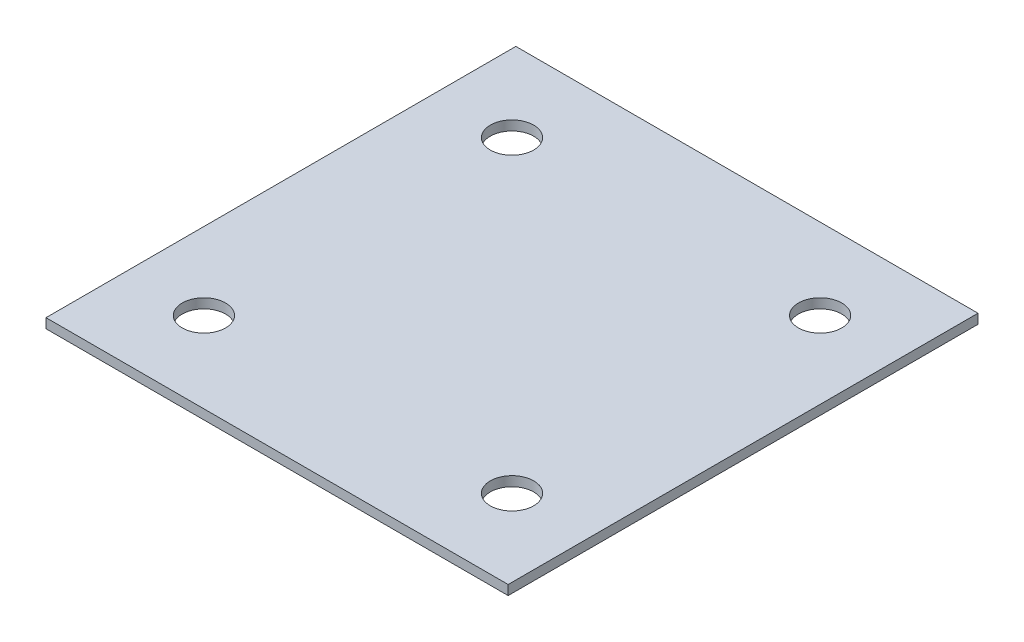
ISO-10303-21;
HEADER;
FILE_DESCRIPTION(('STEP AP214'),'2;1');
FILE_NAME('part.step','',(''),(''),'','','');
FILE_SCHEMA(('AUTOMOTIVE_DESIGN { 1 0 10303 214 1 1 1 1 }'));
ENDSEC;
DATA;
#1=APPLICATION_CONTEXT('core data for automotive mechanical design processes');
#2=APPLICATION_PROTOCOL_DEFINITION('international standard','automotive_design',2000,#1);
#3=PRODUCT_CONTEXT('',#1,'mechanical');
#4=PRODUCT('Part','Part','',(#3));
#5=PRODUCT_RELATED_PRODUCT_CATEGORY('part','',(#4));
#6=PRODUCT_DEFINITION_FORMATION('','',#4);
#7=PRODUCT_DEFINITION_CONTEXT('part definition',#1,'design');
#8=PRODUCT_DEFINITION('design','',#6,#7);
#9=PRODUCT_DEFINITION_SHAPE('','',#8);
#10=(LENGTH_UNIT() NAMED_UNIT(*) SI_UNIT(.MILLI.,.METRE.));
#11=(NAMED_UNIT(*) PLANE_ANGLE_UNIT() SI_UNIT($,.RADIAN.));
#12=(NAMED_UNIT(*) SI_UNIT($,.STERADIAN.) SOLID_ANGLE_UNIT());
#13=UNCERTAINTY_MEASURE_WITH_UNIT(LENGTH_MEASURE(1.E-05),#10,'distance_accuracy_value','');
#14=(GEOMETRIC_REPRESENTATION_CONTEXT(3) GLOBAL_UNCERTAINTY_ASSIGNED_CONTEXT((#13)) GLOBAL_UNIT_ASSIGNED_CONTEXT((#10,
#11,#12)) REPRESENTATION_CONTEXT('',''));
#15=CARTESIAN_POINT('',(0.,0.,0.));
#16=DIRECTION('',(0.,0.,1.));
#17=DIRECTION('',(1.,0.,0.));
#18=AXIS2_PLACEMENT_3D('',#15,#16,#17);
#19=CARTESIAN_POINT('',(0.,3.175,0.));
#20=DIRECTION('',(0.,-1.,0.));
#21=DIRECTION('',(0.,0.,-1.));
#22=AXIS2_PLACEMENT_3D('',#19,#20,#21);
#23=PLANE('',#22);
#24=DIRECTION('',(0.,0.,1.));
#25=VECTOR('',#24,1.);
#26=CARTESIAN_POINT('',(0.,3.175,0.));
#27=LINE('',#26,#25);
#28=CARTESIAN_POINT('',(0.,3.175,-309.88));
#29=VERTEX_POINT('',#28);
#30=CARTESIAN_POINT('',(0.,3.175,0.));
#31=VERTEX_POINT('',#30);
#32=EDGE_CURVE('E98',#29,#31,#27,.T.);
#33=ORIENTED_EDGE('',*,*,#32,.T.);
#34=DIRECTION('',(1.,0.,0.));
#35=VECTOR('',#34,1.);
#36=CARTESIAN_POINT('',(0.,3.175,0.));
#37=LINE('',#36,#35);
#38=CARTESIAN_POINT('',(304.8,3.175,0.));
#39=VERTEX_POINT('',#38);
#40=EDGE_CURVE('E93',#31,#39,#37,.T.);
#41=ORIENTED_EDGE('',*,*,#40,.T.);
#42=DIRECTION('',(0.,0.,-1.));
#43=VECTOR('',#42,1.);
#44=CARTESIAN_POINT('',(304.8,3.175,0.));
#45=LINE('',#44,#43);
#46=CARTESIAN_POINT('',(304.8,3.175,-309.88));
#47=VERTEX_POINT('',#46);
#48=EDGE_CURVE('E96',#39,#47,#45,.T.);
#49=ORIENTED_EDGE('',*,*,#48,.T.);
#50=DIRECTION('',(-1.,0.,0.));
#51=VECTOR('',#50,1.);
#52=CARTESIAN_POINT('',(0.,3.175,-309.88));
#53=LINE('',#52,#51);
#54=EDGE_CURVE('E63',#47,#29,#53,.T.);
#55=ORIENTED_EDGE('',*,*,#54,.T.);
#56=EDGE_LOOP('',(#33,#41,#49,#55));
#57=FACE_BOUND('',#56,.T.);
#58=CARTESIAN_POINT('',(50.8,3.175,-53.34));
#59=DIRECTION('',(0.,1.,0.));
#60=DIRECTION('',(0.,0.,1.));
#61=AXIS2_PLACEMENT_3D('',#58,#59,#60);
#62=CIRCLE('',#61,14.2875);
#63=CARTESIAN_POINT('',(50.8,3.175,-39.0525));
#64=VERTEX_POINT('',#63);
#65=EDGE_CURVE('E118',#64,#64,#62,.T.);
#66=ORIENTED_EDGE('',*,*,#65,.F.);
#67=EDGE_LOOP('',(#66));
#68=FACE_BOUND('',#67,.T.);
#69=CARTESIAN_POINT('',(254.,3.175,-53.34));
#70=DIRECTION('',(0.,1.,0.));
#71=DIRECTION('',(0.,0.,1.));
#72=AXIS2_PLACEMENT_3D('',#69,#70,#71);
#73=CIRCLE('',#72,14.2875);
#74=CARTESIAN_POINT('',(254.,3.175,-39.0525));
#75=VERTEX_POINT('',#74);
#76=EDGE_CURVE('E140',#75,#75,#73,.T.);
#77=ORIENTED_EDGE('',*,*,#76,.F.);
#78=EDGE_LOOP('',(#77));
#79=FACE_BOUND('',#78,.T.);
#80=CARTESIAN_POINT('',(50.8,3.175,-256.54));
#81=DIRECTION('',(0.,1.,0.));
#82=DIRECTION('',(0.,0.,1.));
#83=AXIS2_PLACEMENT_3D('',#80,#81,#82);
#84=CIRCLE('',#83,14.2875);
#85=CARTESIAN_POINT('',(50.8,3.175,-242.2525));
#86=VERTEX_POINT('',#85);
#87=EDGE_CURVE('E148',#86,#86,#84,.T.);
#88=ORIENTED_EDGE('',*,*,#87,.F.);
#89=EDGE_LOOP('',(#88));
#90=FACE_BOUND('',#89,.T.);
#91=CARTESIAN_POINT('',(254.,3.175,-256.54));
#92=DIRECTION('',(0.,1.,0.));
#93=DIRECTION('',(0.,0.,1.));
#94=AXIS2_PLACEMENT_3D('',#91,#92,#93);
#95=CIRCLE('',#94,14.2875);
#96=CARTESIAN_POINT('',(254.,3.175,-242.2525));
#97=VERTEX_POINT('',#96);
#98=EDGE_CURVE('E156',#97,#97,#95,.T.);
#99=ORIENTED_EDGE('',*,*,#98,.F.);
#100=EDGE_LOOP('',(#99));
#101=FACE_BOUND('',#100,.T.);
#102=ADVANCED_FACE('F45',(#57,#68,#79,#90,#101),#23,.F.);
#103=CARTESIAN_POINT('',(0.,-3.175,0.));
#104=DIRECTION('',(0.,-1.,0.));
#105=DIRECTION('',(0.,0.,-1.));
#106=AXIS2_PLACEMENT_3D('',#103,#104,#105);
#107=PLANE('',#106);
#108=CARTESIAN_POINT('',(50.8,-3.175,-256.54));
#109=DIRECTION('',(0.,1.,0.));
#110=DIRECTION('',(0.,0.,1.));
#111=AXIS2_PLACEMENT_3D('',#108,#109,#110);
#112=CIRCLE('',#111,14.2875);
#113=CARTESIAN_POINT('',(50.8,-3.175,-242.2525));
#114=VERTEX_POINT('',#113);
#115=EDGE_CURVE('E152',#114,#114,#112,.T.);
#116=ORIENTED_EDGE('',*,*,#115,.T.);
#117=EDGE_LOOP('',(#116));
#118=FACE_BOUND('',#117,.T.);
#119=CARTESIAN_POINT('',(50.8,-3.175,-53.34));
#120=DIRECTION('',(0.,1.,0.));
#121=DIRECTION('',(0.,0.,1.));
#122=AXIS2_PLACEMENT_3D('',#119,#120,#121);
#123=CIRCLE('',#122,14.2875);
#124=CARTESIAN_POINT('',(50.8,-3.175,-39.0525));
#125=VERTEX_POINT('',#124);
#126=EDGE_CURVE('E136',#125,#125,#123,.T.);
#127=ORIENTED_EDGE('',*,*,#126,.T.);
#128=EDGE_LOOP('',(#127));
#129=FACE_BOUND('',#128,.T.);
#130=DIRECTION('',(0.,0.,1.));
#131=VECTOR('',#130,1.);
#132=CARTESIAN_POINT('',(0.,-3.175,0.));
#133=LINE('',#132,#131);
#134=CARTESIAN_POINT('',(0.,-3.175,-309.88));
#135=VERTEX_POINT('',#134);
#136=CARTESIAN_POINT('',(0.,-3.175,0.));
#137=VERTEX_POINT('',#136);
#138=EDGE_CURVE('E114',#135,#137,#133,.T.);
#139=ORIENTED_EDGE('',*,*,#138,.F.);
#140=DIRECTION('',(-1.,0.,0.));
#141=VECTOR('',#140,1.);
#142=CARTESIAN_POINT('',(0.,-3.175,-309.88));
#143=LINE('',#142,#141);
#144=CARTESIAN_POINT('',(304.8,-3.175,-309.88));
#145=VERTEX_POINT('',#144);
#146=EDGE_CURVE('E86',#145,#135,#143,.T.);
#147=ORIENTED_EDGE('',*,*,#146,.F.);
#148=DIRECTION('',(0.,0.,-1.));
#149=VECTOR('',#148,1.);
#150=CARTESIAN_POINT('',(304.8,-3.175,0.));
#151=LINE('',#150,#149);
#152=CARTESIAN_POINT('',(304.8,-3.175,0.));
#153=VERTEX_POINT('',#152);
#154=EDGE_CURVE('E80',#153,#145,#151,.T.);
#155=ORIENTED_EDGE('',*,*,#154,.F.);
#156=DIRECTION('',(1.,0.,0.));
#157=VECTOR('',#156,1.);
#158=CARTESIAN_POINT('',(0.,-3.175,0.));
#159=LINE('',#158,#157);
#160=EDGE_CURVE('E103',#137,#153,#159,.T.);
#161=ORIENTED_EDGE('',*,*,#160,.F.);
#162=EDGE_LOOP('',(#139,#147,#155,#161));
#163=FACE_BOUND('',#162,.T.);
#164=CARTESIAN_POINT('',(254.,-3.175,-53.34));
#165=DIRECTION('',(0.,1.,0.));
#166=DIRECTION('',(0.,0.,1.));
#167=AXIS2_PLACEMENT_3D('',#164,#165,#166);
#168=CIRCLE('',#167,14.2875);
#169=CARTESIAN_POINT('',(254.,-3.175,-39.0525));
#170=VERTEX_POINT('',#169);
#171=EDGE_CURVE('E144',#170,#170,#168,.T.);
#172=ORIENTED_EDGE('',*,*,#171,.T.);
#173=EDGE_LOOP('',(#172));
#174=FACE_BOUND('',#173,.T.);
#175=CARTESIAN_POINT('',(254.,-3.175,-256.54));
#176=DIRECTION('',(0.,1.,0.));
#177=DIRECTION('',(0.,0.,1.));
#178=AXIS2_PLACEMENT_3D('',#175,#176,#177);
#179=CIRCLE('',#178,14.2875);
#180=CARTESIAN_POINT('',(254.,-3.175,-242.2525));
#181=VERTEX_POINT('',#180);
#182=EDGE_CURVE('E160',#181,#181,#179,.T.);
#183=ORIENTED_EDGE('',*,*,#182,.T.);
#184=EDGE_LOOP('',(#183));
#185=FACE_BOUND('',#184,.T.);
#186=ADVANCED_FACE('F131',(#118,#129,#163,#174,#185),#107,.T.);
#187=CARTESIAN_POINT('',(0.,3.175,0.));
#188=DIRECTION('',(1.,0.,0.));
#189=DIRECTION('',(0.,0.,-1.));
#190=AXIS2_PLACEMENT_3D('',#187,#188,#189);
#191=PLANE('',#190);
#192=ORIENTED_EDGE('',*,*,#138,.T.);
#193=DIRECTION('',(0.,-1.,0.));
#194=VECTOR('',#193,1.);
#195=CARTESIAN_POINT('',(0.,3.175,0.));
#196=LINE('',#195,#194);
#197=EDGE_CURVE('E11',#31,#137,#196,.T.);
#198=ORIENTED_EDGE('',*,*,#197,.F.);
#199=ORIENTED_EDGE('',*,*,#32,.F.);
#200=DIRECTION('',(0.,-1.,0.));
#201=VECTOR('',#200,1.);
#202=CARTESIAN_POINT('',(0.,3.175,-309.88));
#203=LINE('',#202,#201);
#204=EDGE_CURVE('E110',#29,#135,#203,.T.);
#205=ORIENTED_EDGE('',*,*,#204,.T.);
#206=EDGE_LOOP('',(#192,#198,#199,#205));
#207=FACE_BOUND('',#206,.T.);
#208=ADVANCED_FACE('F47',(#207),#191,.F.);
#209=CARTESIAN_POINT('',(0.,3.175,0.));
#210=DIRECTION('',(0.,0.,-1.));
#211=DIRECTION('',(-1.,0.,0.));
#212=AXIS2_PLACEMENT_3D('',#209,#210,#211);
#213=PLANE('',#212);
#214=ORIENTED_EDGE('',*,*,#160,.T.);
#215=DIRECTION('',(0.,-1.,0.));
#216=VECTOR('',#215,1.);
#217=CARTESIAN_POINT('',(304.8,3.175,0.));
#218=LINE('',#217,#216);
#219=EDGE_CURVE('E55',#39,#153,#218,.T.);
#220=ORIENTED_EDGE('',*,*,#219,.F.);
#221=ORIENTED_EDGE('',*,*,#40,.F.);
#222=ORIENTED_EDGE('',*,*,#197,.T.);
#223=EDGE_LOOP('',(#214,#220,#221,#222));
#224=FACE_BOUND('',#223,.T.);
#225=ADVANCED_FACE('F102',(#224),#213,.F.);
#226=CARTESIAN_POINT('',(304.8,3.175,0.));
#227=DIRECTION('',(-1.,0.,0.));
#228=DIRECTION('',(0.,0.,1.));
#229=AXIS2_PLACEMENT_3D('',#226,#227,#228);
#230=PLANE('',#229);
#231=ORIENTED_EDGE('',*,*,#154,.T.);
#232=DIRECTION('',(0.,-1.,0.));
#233=VECTOR('',#232,1.);
#234=CARTESIAN_POINT('',(304.8,3.175,-309.88));
#235=LINE('',#234,#233);
#236=EDGE_CURVE('E105',#47,#145,#235,.T.);
#237=ORIENTED_EDGE('',*,*,#236,.F.);
#238=ORIENTED_EDGE('',*,*,#48,.F.);
#239=ORIENTED_EDGE('',*,*,#219,.T.);
#240=EDGE_LOOP('',(#231,#237,#238,#239));
#241=FACE_BOUND('',#240,.T.);
#242=ADVANCED_FACE('F106',(#241),#230,.F.);
#243=CARTESIAN_POINT('',(0.,3.175,-309.88));
#244=DIRECTION('',(0.,0.,1.));
#245=DIRECTION('',(1.,0.,0.));
#246=AXIS2_PLACEMENT_3D('',#243,#244,#245);
#247=PLANE('',#246);
#248=ORIENTED_EDGE('',*,*,#146,.T.);
#249=ORIENTED_EDGE('',*,*,#204,.F.);
#250=ORIENTED_EDGE('',*,*,#54,.F.);
#251=ORIENTED_EDGE('',*,*,#236,.T.);
#252=EDGE_LOOP('',(#248,#249,#250,#251));
#253=FACE_BOUND('',#252,.T.);
#254=ADVANCED_FACE('F128',(#253),#247,.F.);
#255=CARTESIAN_POINT('',(50.8,3.175,-53.34));
#256=DIRECTION('',(0.,-1.,0.));
#257=DIRECTION('',(0.,0.,-1.));
#258=AXIS2_PLACEMENT_3D('',#255,#256,#257);
#259=CYLINDRICAL_SURFACE('',#258,14.2875);
#260=ORIENTED_EDGE('',*,*,#65,.T.);
#261=EDGE_LOOP('',(#260));
#262=FACE_BOUND('',#261,.T.);
#263=ORIENTED_EDGE('',*,*,#126,.F.);
#264=EDGE_LOOP('',(#263));
#265=FACE_BOUND('',#264,.T.);
#266=ADVANCED_FACE('F179',(#262,#265),#259,.F.);
#267=CARTESIAN_POINT('',(254.,3.175,-53.34));
#268=DIRECTION('',(0.,-1.,0.));
#269=DIRECTION('',(0.,0.,-1.));
#270=AXIS2_PLACEMENT_3D('',#267,#268,#269);
#271=CYLINDRICAL_SURFACE('',#270,14.2875);
#272=ORIENTED_EDGE('',*,*,#76,.T.);
#273=EDGE_LOOP('',(#272));
#274=FACE_BOUND('',#273,.T.);
#275=ORIENTED_EDGE('',*,*,#171,.F.);
#276=EDGE_LOOP('',(#275));
#277=FACE_BOUND('',#276,.T.);
#278=ADVANCED_FACE('F224',(#274,#277),#271,.F.);
#279=CARTESIAN_POINT('',(50.8,3.175,-256.54));
#280=DIRECTION('',(0.,-1.,0.));
#281=DIRECTION('',(0.,0.,-1.));
#282=AXIS2_PLACEMENT_3D('',#279,#280,#281);
#283=CYLINDRICAL_SURFACE('',#282,14.2875);
#284=ORIENTED_EDGE('',*,*,#87,.T.);
#285=EDGE_LOOP('',(#284));
#286=FACE_BOUND('',#285,.T.);
#287=ORIENTED_EDGE('',*,*,#115,.F.);
#288=EDGE_LOOP('',(#287));
#289=FACE_BOUND('',#288,.T.);
#290=ADVANCED_FACE('F232',(#286,#289),#283,.F.);
#291=CARTESIAN_POINT('',(254.,3.175,-256.54));
#292=DIRECTION('',(0.,-1.,0.));
#293=DIRECTION('',(0.,0.,-1.));
#294=AXIS2_PLACEMENT_3D('',#291,#292,#293);
#295=CYLINDRICAL_SURFACE('',#294,14.2875);
#296=ORIENTED_EDGE('',*,*,#98,.T.);
#297=EDGE_LOOP('',(#296));
#298=FACE_BOUND('',#297,.T.);
#299=ORIENTED_EDGE('',*,*,#182,.F.);
#300=EDGE_LOOP('',(#299));
#301=FACE_BOUND('',#300,.T.);
#302=ADVANCED_FACE('F168',(#298,#301),#295,.F.);
#303=CLOSED_SHELL('',(#102,#186,#208,#225,#242,#254,#266,#278,#290,#302));
#304=MANIFOLD_SOLID_BREP('B2',#303);
#305=ADVANCED_BREP_SHAPE_REPRESENTATION('',(#18,#304),#14);
#306=SHAPE_DEFINITION_REPRESENTATION(#9,#305);
ENDSEC;
END-ISO-10303-21;
